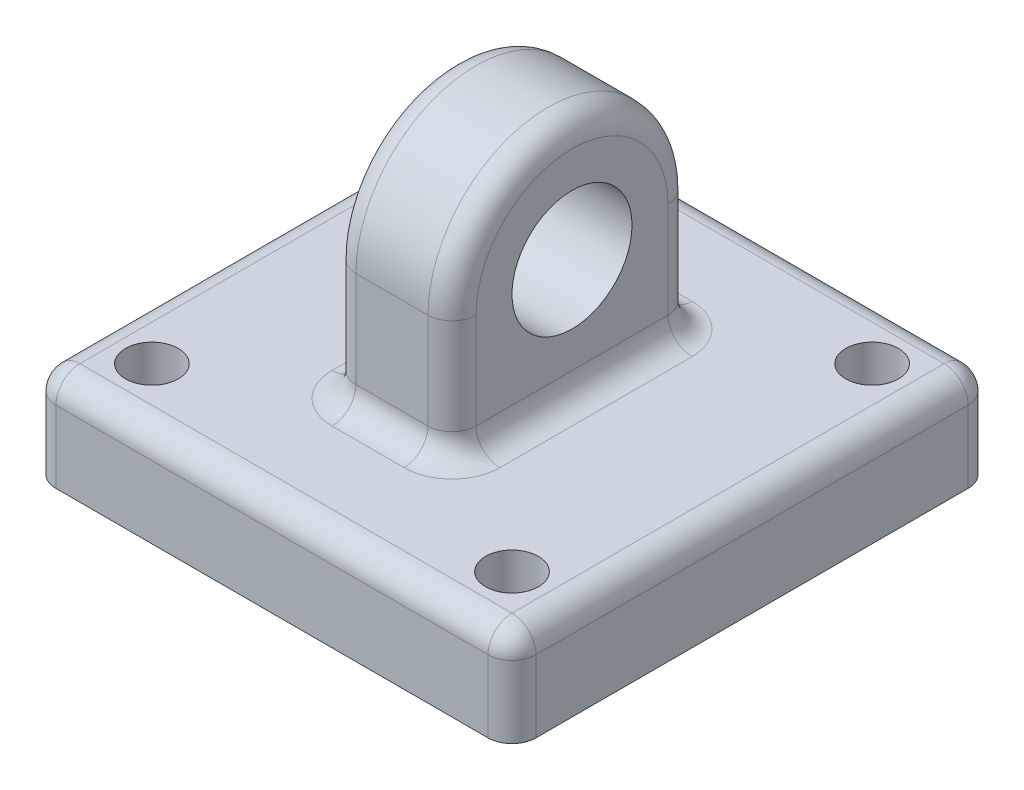
ISO-10303-21;
HEADER;
FILE_DESCRIPTION(('STEP AP214'),'2;1');
FILE_NAME('part.step','',(''),(''),'','','');
FILE_SCHEMA(('AUTOMOTIVE_DESIGN { 1 0 10303 214 1 1 1 1 }'));
ENDSEC;
DATA;
#1=APPLICATION_CONTEXT('core data for automotive mechanical design processes');
#2=APPLICATION_PROTOCOL_DEFINITION('international standard','automotive_design',2000,#1);
#3=PRODUCT_CONTEXT('',#1,'mechanical');
#4=PRODUCT('Part','Part','',(#3));
#5=PRODUCT_RELATED_PRODUCT_CATEGORY('part','',(#4));
#6=PRODUCT_DEFINITION_FORMATION('','',#4);
#7=PRODUCT_DEFINITION_CONTEXT('part definition',#1,'design');
#8=PRODUCT_DEFINITION('design','',#6,#7);
#9=PRODUCT_DEFINITION_SHAPE('','',#8);
#10=(LENGTH_UNIT() NAMED_UNIT(*) SI_UNIT(.MILLI.,.METRE.));
#11=(NAMED_UNIT(*) PLANE_ANGLE_UNIT() SI_UNIT($,.RADIAN.));
#12=(NAMED_UNIT(*) SI_UNIT($,.STERADIAN.) SOLID_ANGLE_UNIT());
#13=UNCERTAINTY_MEASURE_WITH_UNIT(LENGTH_MEASURE(1.E-05),#10,'distance_accuracy_value','');
#14=(GEOMETRIC_REPRESENTATION_CONTEXT(3) GLOBAL_UNCERTAINTY_ASSIGNED_CONTEXT((#13)) GLOBAL_UNIT_ASSIGNED_CONTEXT((#10,
#11,#12)) REPRESENTATION_CONTEXT('',''));
#15=CARTESIAN_POINT('',(0.,0.,0.));
#16=DIRECTION('',(0.,0.,1.));
#17=DIRECTION('',(1.,0.,0.));
#18=AXIS2_PLACEMENT_3D('',#15,#16,#17);
#19=CARTESIAN_POINT('',(0.,-5.,0.));
#20=DIRECTION('',(0.,1.,0.));
#21=DIRECTION('',(0.,0.,1.));
#22=AXIS2_PLACEMENT_3D('',#19,#20,#21);
#23=PLANE('',#22);
#24=CARTESIAN_POINT('',(7.5,-5.,7.5));
#25=DIRECTION('',(0.,1.,0.));
#26=DIRECTION('',(0.,0.,1.));
#27=AXIS2_PLACEMENT_3D('',#24,#25,#26);
#28=CIRCLE('',#27,1.1);
#29=CARTESIAN_POINT('',(7.5,-5.,8.6));
#30=VERTEX_POINT('',#29);
#31=EDGE_CURVE('E406',#30,#30,#28,.T.);
#32=ORIENTED_EDGE('',*,*,#31,.F.);
#33=EDGE_LOOP('',(#32));
#34=FACE_BOUND('',#33,.T.);
#35=CARTESIAN_POINT('',(7.5,-5.,-7.5));
#36=DIRECTION('',(0.,1.,0.));
#37=DIRECTION('',(0.,0.,1.));
#38=AXIS2_PLACEMENT_3D('',#35,#36,#37);
#39=CIRCLE('',#38,1.1);
#40=CARTESIAN_POINT('',(7.5,-5.,-6.4));
#41=VERTEX_POINT('',#40);
#42=EDGE_CURVE('E893',#41,#41,#39,.T.);
#43=ORIENTED_EDGE('',*,*,#42,.F.);
#44=EDGE_LOOP('',(#43));
#45=FACE_BOUND('',#44,.T.);
#46=CARTESIAN_POINT('',(-7.5,-5.,-7.5));
#47=DIRECTION('',(0.,1.,0.));
#48=DIRECTION('',(0.,0.,1.));
#49=AXIS2_PLACEMENT_3D('',#46,#47,#48);
#50=CIRCLE('',#49,1.1);
#51=CARTESIAN_POINT('',(-7.5,-5.,-6.4));
#52=VERTEX_POINT('',#51);
#53=EDGE_CURVE('E899',#52,#52,#50,.T.);
#54=ORIENTED_EDGE('',*,*,#53,.F.);
#55=EDGE_LOOP('',(#54));
#56=FACE_BOUND('',#55,.T.);
#57=CARTESIAN_POINT('',(-7.5,-5.,7.5));
#58=DIRECTION('',(0.,1.,0.));
#59=DIRECTION('',(0.,0.,1.));
#60=AXIS2_PLACEMENT_3D('',#57,#58,#59);
#61=CIRCLE('',#60,1.1);
#62=CARTESIAN_POINT('',(-7.5,-5.,8.6));
#63=VERTEX_POINT('',#62);
#64=EDGE_CURVE('E347',#63,#63,#61,.T.);
#65=ORIENTED_EDGE('',*,*,#64,.F.);
#66=EDGE_LOOP('',(#65));
#67=FACE_BOUND('',#66,.T.);
#68=DIRECTION('',(0.,0.,1.));
#69=VECTOR('',#68,1.);
#70=CARTESIAN_POINT('',(9.,-5.,-10.));
#71=LINE('',#70,#69);
#72=CARTESIAN_POINT('',(9.,-5.,9.));
#73=VERTEX_POINT('',#72);
#74=CARTESIAN_POINT('',(9.,-5.,-9.));
#75=VERTEX_POINT('',#74);
#76=EDGE_CURVE('E228',#73,#75,#71,.F.);
#77=ORIENTED_EDGE('',*,*,#76,.T.);
#78=DIRECTION('',(1.,0.,0.));
#79=VECTOR('',#78,1.);
#80=CARTESIAN_POINT('',(-10.,-5.,-9.));
#81=LINE('',#80,#79);
#82=CARTESIAN_POINT('',(-9.,-5.,-9.));
#83=VERTEX_POINT('',#82);
#84=EDGE_CURVE('E234',#75,#83,#81,.F.);
#85=ORIENTED_EDGE('',*,*,#84,.T.);
#86=DIRECTION('',(0.,0.,-1.));
#87=VECTOR('',#86,1.);
#88=CARTESIAN_POINT('',(-9.,-5.,10.));
#89=LINE('',#88,#87);
#90=CARTESIAN_POINT('',(-9.,-5.,9.));
#91=VERTEX_POINT('',#90);
#92=EDGE_CURVE('E232',#83,#91,#89,.F.);
#93=ORIENTED_EDGE('',*,*,#92,.T.);
#94=DIRECTION('',(-1.,0.,0.));
#95=VECTOR('',#94,1.);
#96=CARTESIAN_POINT('',(10.,-5.,9.));
#97=LINE('',#96,#95);
#98=EDGE_CURVE('E230',#91,#73,#97,.F.);
#99=ORIENTED_EDGE('',*,*,#98,.T.);
#100=EDGE_LOOP('',(#77,#85,#93,#99));
#101=FACE_BOUND('',#100,.T.);
#102=CARTESIAN_POINT('',(-1.5,-5.,-4.));
#103=DIRECTION('',(0.,1.,0.));
#104=DIRECTION('',(0.,0.,1.));
#105=AXIS2_PLACEMENT_3D('',#102,#103,#104);
#106=CIRCLE('',#105,2.);
#107=CARTESIAN_POINT('',(-1.5,-5.,-6.));
#108=VERTEX_POINT('',#107);
#109=CARTESIAN_POINT('',(-3.5,-5.,-4.));
#110=VERTEX_POINT('',#109);
#111=EDGE_CURVE('E255',#108,#110,#106,.T.);
#112=ORIENTED_EDGE('',*,*,#111,.F.);
#113=DIRECTION('',(-1.,0.,0.));
#114=VECTOR('',#113,1.);
#115=CARTESIAN_POINT('',(0.,-5.,-6.));
#116=LINE('',#115,#114);
#117=CARTESIAN_POINT('',(1.5,-5.,-6.));
#118=VERTEX_POINT('',#117);
#119=EDGE_CURVE('E252',#108,#118,#116,.F.);
#120=ORIENTED_EDGE('',*,*,#119,.T.);
#121=CARTESIAN_POINT('',(1.5,-5.,-4.));
#122=DIRECTION('',(0.,1.,0.));
#123=DIRECTION('',(0.,0.,1.));
#124=AXIS2_PLACEMENT_3D('',#121,#122,#123);
#125=CIRCLE('',#124,2.);
#126=CARTESIAN_POINT('',(3.5,-5.,-4.));
#127=VERTEX_POINT('',#126);
#128=EDGE_CURVE('E249',#127,#118,#125,.T.);
#129=ORIENTED_EDGE('',*,*,#128,.F.);
#130=DIRECTION('',(0.,0.,-1.));
#131=VECTOR('',#130,1.);
#132=CARTESIAN_POINT('',(3.5,-5.,5.));
#133=LINE('',#132,#131);
#134=CARTESIAN_POINT('',(3.5,-5.,4.));
#135=VERTEX_POINT('',#134);
#136=EDGE_CURVE('E247',#127,#135,#133,.F.);
#137=ORIENTED_EDGE('',*,*,#136,.T.);
#138=CARTESIAN_POINT('',(1.5,-5.,4.));
#139=DIRECTION('',(0.,1.,0.));
#140=DIRECTION('',(0.,0.,1.));
#141=AXIS2_PLACEMENT_3D('',#138,#139,#140);
#142=CIRCLE('',#141,2.);
#143=CARTESIAN_POINT('',(1.5,-5.,6.));
#144=VERTEX_POINT('',#143);
#145=EDGE_CURVE('E244',#144,#135,#142,.T.);
#146=ORIENTED_EDGE('',*,*,#145,.F.);
#147=DIRECTION('',(-1.,0.,0.));
#148=VECTOR('',#147,1.);
#149=CARTESIAN_POINT('',(0.,-5.,6.));
#150=LINE('',#149,#148);
#151=CARTESIAN_POINT('',(-1.5,-5.,6.));
#152=VERTEX_POINT('',#151);
#153=EDGE_CURVE('E240',#144,#152,#150,.T.);
#154=ORIENTED_EDGE('',*,*,#153,.T.);
#155=CARTESIAN_POINT('',(-1.5,-5.,4.));
#156=DIRECTION('',(0.,1.,0.));
#157=DIRECTION('',(0.,0.,1.));
#158=AXIS2_PLACEMENT_3D('',#155,#156,#157);
#159=CIRCLE('',#158,2.);
#160=CARTESIAN_POINT('',(-3.5,-5.,4.));
#161=VERTEX_POINT('',#160);
#162=EDGE_CURVE('E237',#161,#152,#159,.T.);
#163=ORIENTED_EDGE('',*,*,#162,.F.);
#164=DIRECTION('',(0.,0.,-1.));
#165=VECTOR('',#164,1.);
#166=CARTESIAN_POINT('',(-3.5,-5.,0.));
#167=LINE('',#166,#165);
#168=EDGE_CURVE('E242',#161,#110,#167,.T.);
#169=ORIENTED_EDGE('',*,*,#168,.T.);
#170=EDGE_LOOP('',(#112,#120,#129,#137,#146,#154,#163,#169));
#171=FACE_BOUND('',#170,.T.);
#172=ADVANCED_FACE('F35',(#34,#45,#56,#67,#101,#171),#23,.T.);
#173=CARTESIAN_POINT('',(2.5,0.,0.));
#174=DIRECTION('',(1.,0.,0.));
#175=DIRECTION('',(0.,0.,-1.));
#176=AXIS2_PLACEMENT_3D('',#173,#174,#175);
#177=PLANE('',#176);
#178=DIRECTION('',(0.,-1.,0.));
#179=VECTOR('',#178,1.);
#180=CARTESIAN_POINT('',(2.5,-5.,4.));
#181=LINE('',#180,#179);
#182=CARTESIAN_POINT('',(2.5,0.,4.));
#183=VERTEX_POINT('',#182);
#184=CARTESIAN_POINT('',(2.5,-4.,4.));
#185=VERTEX_POINT('',#184);
#186=EDGE_CURVE('E258',#183,#185,#181,.T.);
#187=ORIENTED_EDGE('',*,*,#186,.T.);
#188=DIRECTION('',(0.,0.,-1.));
#189=VECTOR('',#188,1.);
#190=CARTESIAN_POINT('',(2.5,-4.,-5.));
#191=LINE('',#190,#189);
#192=CARTESIAN_POINT('',(2.5,-4.,-4.));
#193=VERTEX_POINT('',#192);
#194=EDGE_CURVE('E263',#185,#193,#191,.T.);
#195=ORIENTED_EDGE('',*,*,#194,.T.);
#196=DIRECTION('',(0.,1.,0.));
#197=VECTOR('',#196,1.);
#198=CARTESIAN_POINT('',(2.5,0.,-4.));
#199=LINE('',#198,#197);
#200=CARTESIAN_POINT('',(2.5,0.,-4.));
#201=VERTEX_POINT('',#200);
#202=EDGE_CURVE('E261',#193,#201,#199,.T.);
#203=ORIENTED_EDGE('',*,*,#202,.T.);
#204=CARTESIAN_POINT('',(2.5,0.,0.));
#205=DIRECTION('',(1.,0.,0.));
#206=DIRECTION('',(0.,0.,-1.));
#207=AXIS2_PLACEMENT_3D('',#204,#205,#206);
#208=CIRCLE('',#207,4.);
#209=EDGE_CURVE('E213',#201,#183,#208,.T.);
#210=ORIENTED_EDGE('',*,*,#209,.T.);
#211=EDGE_LOOP('',(#187,#195,#203,#210));
#212=FACE_BOUND('',#211,.T.);
#213=CARTESIAN_POINT('',(2.5,0.,0.));
#214=DIRECTION('',(1.,0.,0.));
#215=DIRECTION('',(0.,0.,-1.));
#216=AXIS2_PLACEMENT_3D('',#213,#214,#215);
#217=CIRCLE('',#216,2.5);
#218=CARTESIAN_POINT('',(2.5,0.,-2.5));
#219=VERTEX_POINT('',#218);
#220=EDGE_CURVE('E207',#219,#219,#217,.T.);
#221=ORIENTED_EDGE('',*,*,#220,.F.);
#222=EDGE_LOOP('',(#221));
#223=FACE_BOUND('',#222,.T.);
#224=ADVANCED_FACE('F435',(#212,#223),#177,.T.);
#225=CARTESIAN_POINT('',(-2.5,0.,0.));
#226=DIRECTION('',(1.,0.,0.));
#227=DIRECTION('',(0.,0.,-1.));
#228=AXIS2_PLACEMENT_3D('',#225,#226,#227);
#229=PLANE('',#228);
#230=DIRECTION('',(0.,1.,0.));
#231=VECTOR('',#230,1.);
#232=CARTESIAN_POINT('',(-2.5,0.,-4.));
#233=LINE('',#232,#231);
#234=CARTESIAN_POINT('',(-2.5,0.,-4.));
#235=VERTEX_POINT('',#234);
#236=CARTESIAN_POINT('',(-2.5,-4.,-4.));
#237=VERTEX_POINT('',#236);
#238=EDGE_CURVE('E270',#235,#237,#233,.F.);
#239=ORIENTED_EDGE('',*,*,#238,.T.);
#240=DIRECTION('',(0.,0.,-1.));
#241=VECTOR('',#240,1.);
#242=CARTESIAN_POINT('',(-2.5,-4.,0.));
#243=LINE('',#242,#241);
#244=CARTESIAN_POINT('',(-2.5,-4.,4.));
#245=VERTEX_POINT('',#244);
#246=EDGE_CURVE('E197',#237,#245,#243,.F.);
#247=ORIENTED_EDGE('',*,*,#246,.T.);
#248=DIRECTION('',(0.,-1.,0.));
#249=VECTOR('',#248,1.);
#250=CARTESIAN_POINT('',(-2.5,0.,4.));
#251=LINE('',#250,#249);
#252=CARTESIAN_POINT('',(-2.5,0.,4.));
#253=VERTEX_POINT('',#252);
#254=EDGE_CURVE('E266',#245,#253,#251,.F.);
#255=ORIENTED_EDGE('',*,*,#254,.T.);
#256=CARTESIAN_POINT('',(-2.5,0.,0.));
#257=DIRECTION('',(1.,0.,0.));
#258=DIRECTION('',(0.,0.,-1.));
#259=AXIS2_PLACEMENT_3D('',#256,#257,#258);
#260=CIRCLE('',#259,4.);
#261=EDGE_CURVE('E268',#253,#235,#260,.F.);
#262=ORIENTED_EDGE('',*,*,#261,.T.);
#263=EDGE_LOOP('',(#239,#247,#255,#262));
#264=FACE_BOUND('',#263,.T.);
#265=CARTESIAN_POINT('',(-2.5,0.,0.));
#266=DIRECTION('',(1.,0.,0.));
#267=DIRECTION('',(0.,0.,-1.));
#268=AXIS2_PLACEMENT_3D('',#265,#266,#267);
#269=CIRCLE('',#268,2.5);
#270=CARTESIAN_POINT('',(-2.5,0.,-2.5));
#271=VERTEX_POINT('',#270);
#272=EDGE_CURVE('E413',#271,#271,#269,.T.);
#273=ORIENTED_EDGE('',*,*,#272,.T.);
#274=EDGE_LOOP('',(#273));
#275=FACE_BOUND('',#274,.T.);
#276=ADVANCED_FACE('F419',(#264,#275),#229,.F.);
#277=CARTESIAN_POINT('',(2.5,0.,0.));
#278=DIRECTION('',(-1.,0.,0.));
#279=DIRECTION('',(0.,0.,1.));
#280=AXIS2_PLACEMENT_3D('',#277,#278,#279);
#281=CYLINDRICAL_SURFACE('',#280,5.);
#282=DIRECTION('',(-1.,0.,0.));
#283=VECTOR('',#282,1.);
#284=CARTESIAN_POINT('',(2.5,0.,-5.));
#285=LINE('',#284,#283);
#286=CARTESIAN_POINT('',(1.5,0.,-5.));
#287=VERTEX_POINT('',#286);
#288=CARTESIAN_POINT('',(-1.5,0.,-5.));
#289=VERTEX_POINT('',#288);
#290=EDGE_CURVE('E188',#287,#289,#285,.T.);
#291=ORIENTED_EDGE('',*,*,#290,.T.);
#292=CARTESIAN_POINT('',(-1.5,0.,0.));
#293=DIRECTION('',(1.,0.,0.));
#294=DIRECTION('',(0.,0.,-1.));
#295=AXIS2_PLACEMENT_3D('',#292,#293,#294);
#296=CIRCLE('',#295,5.);
#297=CARTESIAN_POINT('',(-1.5,0.,5.));
#298=VERTEX_POINT('',#297);
#299=EDGE_CURVE('E196',#289,#298,#296,.T.);
#300=ORIENTED_EDGE('',*,*,#299,.T.);
#301=DIRECTION('',(-1.,0.,0.));
#302=VECTOR('',#301,1.);
#303=CARTESIAN_POINT('',(2.5,0.,5.));
#304=LINE('',#303,#302);
#305=CARTESIAN_POINT('',(1.5,0.,5.));
#306=VERTEX_POINT('',#305);
#307=EDGE_CURVE('E191',#306,#298,#304,.T.);
#308=ORIENTED_EDGE('',*,*,#307,.F.);
#309=CARTESIAN_POINT('',(1.5,0.,0.));
#310=DIRECTION('',(1.,0.,0.));
#311=DIRECTION('',(0.,0.,-1.));
#312=AXIS2_PLACEMENT_3D('',#309,#310,#311);
#313=CIRCLE('',#312,5.);
#314=EDGE_CURVE('E185',#306,#287,#313,.F.);
#315=ORIENTED_EDGE('',*,*,#314,.T.);
#316=EDGE_LOOP('',(#291,#300,#308,#315));
#317=FACE_BOUND('',#316,.T.);
#318=ADVANCED_FACE('F187',(#317),#281,.T.);
#319=CARTESIAN_POINT('',(2.5,0.,5.));
#320=DIRECTION('',(0.,0.,-1.));
#321=DIRECTION('',(0.,1.,0.));
#322=AXIS2_PLACEMENT_3D('',#319,#320,#321);
#323=PLANE('',#322);
#324=ORIENTED_EDGE('',*,*,#307,.T.);
#325=DIRECTION('',(0.,-1.,0.));
#326=VECTOR('',#325,1.);
#327=CARTESIAN_POINT('',(-1.5,0.,5.));
#328=LINE('',#327,#326);
#329=CARTESIAN_POINT('',(-1.5,-4.,5.));
#330=VERTEX_POINT('',#329);
#331=EDGE_CURVE('E279',#298,#330,#328,.T.);
#332=ORIENTED_EDGE('',*,*,#331,.T.);
#333=DIRECTION('',(-1.,0.,0.));
#334=VECTOR('',#333,1.);
#335=CARTESIAN_POINT('',(2.5,-4.,5.));
#336=LINE('',#335,#334);
#337=CARTESIAN_POINT('',(1.5,-4.,5.));
#338=VERTEX_POINT('',#337);
#339=EDGE_CURVE('E277',#330,#338,#336,.F.);
#340=ORIENTED_EDGE('',*,*,#339,.T.);
#341=DIRECTION('',(0.,-1.,0.));
#342=VECTOR('',#341,1.);
#343=CARTESIAN_POINT('',(1.5,0.,5.));
#344=LINE('',#343,#342);
#345=EDGE_CURVE('E275',#338,#306,#344,.F.);
#346=ORIENTED_EDGE('',*,*,#345,.T.);
#347=EDGE_LOOP('',(#324,#332,#340,#346));
#348=FACE_BOUND('',#347,.T.);
#349=ADVANCED_FACE('F431',(#348),#323,.F.);
#350=CARTESIAN_POINT('',(2.5,0.,-5.));
#351=DIRECTION('',(0.,0.,1.));
#352=DIRECTION('',(1.,0.,0.));
#353=AXIS2_PLACEMENT_3D('',#350,#351,#352);
#354=PLANE('',#353);
#355=DIRECTION('',(-1.,0.,0.));
#356=VECTOR('',#355,1.);
#357=CARTESIAN_POINT('',(2.5,-4.,-5.));
#358=LINE('',#357,#356);
#359=CARTESIAN_POINT('',(1.5,-4.,-5.));
#360=VERTEX_POINT('',#359);
#361=CARTESIAN_POINT('',(-1.5,-4.,-5.));
#362=VERTEX_POINT('',#361);
#363=EDGE_CURVE('E222',#360,#362,#358,.T.);
#364=ORIENTED_EDGE('',*,*,#363,.T.);
#365=DIRECTION('',(0.,1.,0.));
#366=VECTOR('',#365,1.);
#367=CARTESIAN_POINT('',(-1.5,0.,-5.));
#368=LINE('',#367,#366);
#369=EDGE_CURVE('E206',#362,#289,#368,.T.);
#370=ORIENTED_EDGE('',*,*,#369,.T.);
#371=ORIENTED_EDGE('',*,*,#290,.F.);
#372=DIRECTION('',(0.,1.,0.));
#373=VECTOR('',#372,1.);
#374=CARTESIAN_POINT('',(1.5,-5.,-5.));
#375=LINE('',#374,#373);
#376=EDGE_CURVE('E203',#287,#360,#375,.F.);
#377=ORIENTED_EDGE('',*,*,#376,.T.);
#378=EDGE_LOOP('',(#364,#370,#371,#377));
#379=FACE_BOUND('',#378,.T.);
#380=ADVANCED_FACE('F201',(#379),#354,.F.);
#381=CARTESIAN_POINT('',(2.5,0.,0.));
#382=DIRECTION('',(-1.,0.,0.));
#383=DIRECTION('',(0.,0.,1.));
#384=AXIS2_PLACEMENT_3D('',#381,#382,#383);
#385=CYLINDRICAL_SURFACE('',#384,2.5);
#386=ORIENTED_EDGE('',*,*,#220,.T.);
#387=EDGE_LOOP('',(#386));
#388=FACE_BOUND('',#387,.T.);
#389=ORIENTED_EDGE('',*,*,#272,.F.);
#390=EDGE_LOOP('',(#389));
#391=FACE_BOUND('',#390,.T.);
#392=ADVANCED_FACE('F421',(#388,#391),#385,.F.);
#393=CARTESIAN_POINT('',(-10.,-9.,-10.));
#394=DIRECTION('',(1.,0.,0.));
#395=DIRECTION('',(0.,0.,-1.));
#396=AXIS2_PLACEMENT_3D('',#393,#394,#395);
#397=PLANE('',#396);
#398=DIRECTION('',(0.,0.,-1.));
#399=VECTOR('',#398,1.);
#400=CARTESIAN_POINT('',(-10.,-9.,-10.));
#401=LINE('',#400,#399);
#402=CARTESIAN_POINT('',(-10.,-9.,9.));
#403=VERTEX_POINT('',#402);
#404=CARTESIAN_POINT('',(-10.,-9.,-9.));
#405=VERTEX_POINT('',#404);
#406=EDGE_CURVE('E392',#403,#405,#401,.T.);
#407=ORIENTED_EDGE('',*,*,#406,.F.);
#408=DIRECTION('',(0.,1.,0.));
#409=VECTOR('',#408,1.);
#410=CARTESIAN_POINT('',(-10.,-9.,9.));
#411=LINE('',#410,#409);
#412=CARTESIAN_POINT('',(-10.,-6.,9.));
#413=VERTEX_POINT('',#412);
#414=EDGE_CURVE('E306',#403,#413,#411,.T.);
#415=ORIENTED_EDGE('',*,*,#414,.T.);
#416=DIRECTION('',(0.,0.,-1.));
#417=VECTOR('',#416,1.);
#418=CARTESIAN_POINT('',(-10.,-6.,-10.));
#419=LINE('',#418,#417);
#420=CARTESIAN_POINT('',(-10.,-6.,-9.));
#421=VERTEX_POINT('',#420);
#422=EDGE_CURVE('E302',#413,#421,#419,.T.);
#423=ORIENTED_EDGE('',*,*,#422,.T.);
#424=DIRECTION('',(0.,1.,0.));
#425=VECTOR('',#424,1.);
#426=CARTESIAN_POINT('',(-10.,-9.,-9.));
#427=LINE('',#426,#425);
#428=EDGE_CURVE('E304',#421,#405,#427,.F.);
#429=ORIENTED_EDGE('',*,*,#428,.T.);
#430=EDGE_LOOP('',(#407,#415,#423,#429));
#431=FACE_BOUND('',#430,.T.);
#432=ADVANCED_FACE('F391',(#431),#397,.F.);
#433=CARTESIAN_POINT('',(-10.,-9.,-10.));
#434=DIRECTION('',(0.,0.,1.));
#435=DIRECTION('',(1.,0.,0.));
#436=AXIS2_PLACEMENT_3D('',#433,#434,#435);
#437=PLANE('',#436);
#438=DIRECTION('',(1.,0.,0.));
#439=VECTOR('',#438,1.);
#440=CARTESIAN_POINT('',(-10.,-9.,-10.));
#441=LINE('',#440,#439);
#442=CARTESIAN_POINT('',(-9.,-9.,-10.));
#443=VERTEX_POINT('',#442);
#444=CARTESIAN_POINT('',(9.,-9.,-10.));
#445=VERTEX_POINT('',#444);
#446=EDGE_CURVE('E400',#443,#445,#441,.T.);
#447=ORIENTED_EDGE('',*,*,#446,.F.);
#448=DIRECTION('',(0.,1.,0.));
#449=VECTOR('',#448,1.);
#450=CARTESIAN_POINT('',(-9.,-9.,-10.));
#451=LINE('',#450,#449);
#452=CARTESIAN_POINT('',(-9.,-6.,-10.));
#453=VERTEX_POINT('',#452);
#454=EDGE_CURVE('E11',#443,#453,#451,.T.);
#455=ORIENTED_EDGE('',*,*,#454,.T.);
#456=DIRECTION('',(1.,0.,0.));
#457=VECTOR('',#456,1.);
#458=CARTESIAN_POINT('',(10.,-6.,-10.));
#459=LINE('',#458,#457);
#460=CARTESIAN_POINT('',(9.,-6.,-10.));
#461=VERTEX_POINT('',#460);
#462=EDGE_CURVE('E51',#453,#461,#459,.T.);
#463=ORIENTED_EDGE('',*,*,#462,.T.);
#464=DIRECTION('',(0.,1.,0.));
#465=VECTOR('',#464,1.);
#466=CARTESIAN_POINT('',(9.,-9.,-10.));
#467=LINE('',#466,#465);
#468=EDGE_CURVE('E44',#461,#445,#467,.F.);
#469=ORIENTED_EDGE('',*,*,#468,.T.);
#470=EDGE_LOOP('',(#447,#455,#463,#469));
#471=FACE_BOUND('',#470,.T.);
#472=ADVANCED_FACE('F429',(#471),#437,.F.);
#473=CARTESIAN_POINT('',(10.,-9.,-10.));
#474=DIRECTION('',(-1.,0.,0.));
#475=DIRECTION('',(0.,0.,1.));
#476=AXIS2_PLACEMENT_3D('',#473,#474,#475);
#477=PLANE('',#476);
#478=DIRECTION('',(0.,0.,1.));
#479=VECTOR('',#478,1.);
#480=CARTESIAN_POINT('',(10.,-6.,10.));
#481=LINE('',#480,#479);
#482=CARTESIAN_POINT('',(10.,-6.,-9.));
#483=VERTEX_POINT('',#482);
#484=CARTESIAN_POINT('',(10.,-6.,9.));
#485=VERTEX_POINT('',#484);
#486=EDGE_CURVE('E288',#483,#485,#481,.T.);
#487=ORIENTED_EDGE('',*,*,#486,.T.);
#488=DIRECTION('',(0.,1.,0.));
#489=VECTOR('',#488,1.);
#490=CARTESIAN_POINT('',(10.,-9.,9.));
#491=LINE('',#490,#489);
#492=CARTESIAN_POINT('',(10.,-9.,9.));
#493=VERTEX_POINT('',#492);
#494=EDGE_CURVE('E292',#485,#493,#491,.F.);
#495=ORIENTED_EDGE('',*,*,#494,.T.);
#496=DIRECTION('',(0.,0.,1.));
#497=VECTOR('',#496,1.);
#498=CARTESIAN_POINT('',(10.,-9.,-10.));
#499=LINE('',#498,#497);
#500=CARTESIAN_POINT('',(10.,-9.,-9.));
#501=VERTEX_POINT('',#500);
#502=EDGE_CURVE('E403',#501,#493,#499,.T.);
#503=ORIENTED_EDGE('',*,*,#502,.F.);
#504=DIRECTION('',(0.,1.,0.));
#505=VECTOR('',#504,1.);
#506=CARTESIAN_POINT('',(10.,-9.,-9.));
#507=LINE('',#506,#505);
#508=EDGE_CURVE('E290',#501,#483,#507,.T.);
#509=ORIENTED_EDGE('',*,*,#508,.T.);
#510=EDGE_LOOP('',(#487,#495,#503,#509));
#511=FACE_BOUND('',#510,.T.);
#512=ADVANCED_FACE('F450',(#511),#477,.F.);
#513=CARTESIAN_POINT('',(-10.,-9.,10.));
#514=DIRECTION('',(0.,0.,-1.));
#515=DIRECTION('',(-1.,0.,0.));
#516=AXIS2_PLACEMENT_3D('',#513,#514,#515);
#517=PLANE('',#516);
#518=DIRECTION('',(-1.,0.,0.));
#519=VECTOR('',#518,1.);
#520=CARTESIAN_POINT('',(-10.,-9.,10.));
#521=LINE('',#520,#519);
#522=CARTESIAN_POINT('',(9.,-9.,10.));
#523=VERTEX_POINT('',#522);
#524=CARTESIAN_POINT('',(-9.,-9.,10.));
#525=VERTEX_POINT('',#524);
#526=EDGE_CURVE('E411',#523,#525,#521,.T.);
#527=ORIENTED_EDGE('',*,*,#526,.F.);
#528=DIRECTION('',(0.,1.,0.));
#529=VECTOR('',#528,1.);
#530=CARTESIAN_POINT('',(9.,-9.,10.));
#531=LINE('',#530,#529);
#532=CARTESIAN_POINT('',(9.,-6.,10.));
#533=VERTEX_POINT('',#532);
#534=EDGE_CURVE('E285',#523,#533,#531,.T.);
#535=ORIENTED_EDGE('',*,*,#534,.T.);
#536=DIRECTION('',(-1.,0.,0.));
#537=VECTOR('',#536,1.);
#538=CARTESIAN_POINT('',(-10.,-6.,10.));
#539=LINE('',#538,#537);
#540=CARTESIAN_POINT('',(-9.,-6.,10.));
#541=VERTEX_POINT('',#540);
#542=EDGE_CURVE('E281',#533,#541,#539,.T.);
#543=ORIENTED_EDGE('',*,*,#542,.T.);
#544=DIRECTION('',(0.,1.,0.));
#545=VECTOR('',#544,1.);
#546=CARTESIAN_POINT('',(-9.,-9.,10.));
#547=LINE('',#546,#545);
#548=EDGE_CURVE('E283',#541,#525,#547,.F.);
#549=ORIENTED_EDGE('',*,*,#548,.T.);
#550=EDGE_LOOP('',(#527,#535,#543,#549));
#551=FACE_BOUND('',#550,.T.);
#552=ADVANCED_FACE('F447',(#551),#517,.F.);
#553=CARTESIAN_POINT('',(0.,-9.,0.));
#554=DIRECTION('',(0.,1.,0.));
#555=DIRECTION('',(0.,0.,1.));
#556=AXIS2_PLACEMENT_3D('',#553,#554,#555);
#557=PLANE('',#556);
#558=CARTESIAN_POINT('',(-7.5,-9.,7.5));
#559=DIRECTION('',(0.,1.,0.));
#560=DIRECTION('',(0.,0.,1.));
#561=AXIS2_PLACEMENT_3D('',#558,#559,#560);
#562=CIRCLE('',#561,1.1);
#563=CARTESIAN_POINT('',(-7.5,-9.,8.6));
#564=VERTEX_POINT('',#563);
#565=EDGE_CURVE('E881',#564,#564,#562,.F.);
#566=ORIENTED_EDGE('',*,*,#565,.F.);
#567=EDGE_LOOP('',(#566));
#568=FACE_BOUND('',#567,.T.);
#569=CARTESIAN_POINT('',(-7.5,-9.,-7.5));
#570=DIRECTION('',(0.,1.,0.));
#571=DIRECTION('',(0.,0.,1.));
#572=AXIS2_PLACEMENT_3D('',#569,#570,#571);
#573=CIRCLE('',#572,1.1);
#574=CARTESIAN_POINT('',(-7.5,-9.,-6.4));
#575=VERTEX_POINT('',#574);
#576=EDGE_CURVE('E885',#575,#575,#573,.F.);
#577=ORIENTED_EDGE('',*,*,#576,.F.);
#578=EDGE_LOOP('',(#577));
#579=FACE_BOUND('',#578,.T.);
#580=CARTESIAN_POINT('',(7.5,-9.,-7.5));
#581=DIRECTION('',(0.,1.,0.));
#582=DIRECTION('',(0.,0.,1.));
#583=AXIS2_PLACEMENT_3D('',#580,#581,#582);
#584=CIRCLE('',#583,1.1);
#585=CARTESIAN_POINT('',(7.5,-9.,-6.4));
#586=VERTEX_POINT('',#585);
#587=EDGE_CURVE('E889',#586,#586,#584,.F.);
#588=ORIENTED_EDGE('',*,*,#587,.F.);
#589=EDGE_LOOP('',(#588));
#590=FACE_BOUND('',#589,.T.);
#591=CARTESIAN_POINT('',(7.5,-9.,7.5));
#592=DIRECTION('',(0.,1.,0.));
#593=DIRECTION('',(0.,0.,1.));
#594=AXIS2_PLACEMENT_3D('',#591,#592,#593);
#595=CIRCLE('',#594,1.1);
#596=CARTESIAN_POINT('',(7.5,-9.,8.6));
#597=VERTEX_POINT('',#596);
#598=EDGE_CURVE('E401',#597,#597,#595,.F.);
#599=ORIENTED_EDGE('',*,*,#598,.F.);
#600=EDGE_LOOP('',(#599));
#601=FACE_BOUND('',#600,.T.);
#602=ORIENTED_EDGE('',*,*,#502,.T.);
#603=CARTESIAN_POINT('',(9.,-9.,9.));
#604=DIRECTION('',(0.,1.,0.));
#605=DIRECTION('',(0.,0.,1.));
#606=AXIS2_PLACEMENT_3D('',#603,#604,#605);
#607=CIRCLE('',#606,1.);
#608=EDGE_CURVE('E300',#493,#523,#607,.F.);
#609=ORIENTED_EDGE('',*,*,#608,.T.);
#610=ORIENTED_EDGE('',*,*,#526,.T.);
#611=CARTESIAN_POINT('',(-9.,-9.,9.));
#612=DIRECTION('',(0.,1.,0.));
#613=DIRECTION('',(0.,0.,1.));
#614=AXIS2_PLACEMENT_3D('',#611,#612,#613);
#615=CIRCLE('',#614,1.);
#616=EDGE_CURVE('E298',#525,#403,#615,.F.);
#617=ORIENTED_EDGE('',*,*,#616,.T.);
#618=ORIENTED_EDGE('',*,*,#406,.T.);
#619=CARTESIAN_POINT('',(-9.,-9.,-9.));
#620=DIRECTION('',(0.,1.,0.));
#621=DIRECTION('',(0.,0.,1.));
#622=AXIS2_PLACEMENT_3D('',#619,#620,#621);
#623=CIRCLE('',#622,1.);
#624=EDGE_CURVE('E296',#405,#443,#623,.F.);
#625=ORIENTED_EDGE('',*,*,#624,.T.);
#626=ORIENTED_EDGE('',*,*,#446,.T.);
#627=CARTESIAN_POINT('',(9.,-9.,-9.));
#628=DIRECTION('',(0.,1.,0.));
#629=DIRECTION('',(0.,0.,1.));
#630=AXIS2_PLACEMENT_3D('',#627,#628,#629);
#631=CIRCLE('',#630,1.);
#632=EDGE_CURVE('E294',#445,#501,#631,.F.);
#633=ORIENTED_EDGE('',*,*,#632,.T.);
#634=EDGE_LOOP('',(#602,#609,#610,#617,#618,#625,#626,#633));
#635=FACE_BOUND('',#634,.T.);
#636=ADVANCED_FACE('F396',(#568,#579,#590,#601,#635),#557,.F.);
#637=CARTESIAN_POINT('',(7.5,-9.001,7.5));
#638=DIRECTION('',(0.,1.,0.));
#639=DIRECTION('',(0.,0.,1.));
#640=AXIS2_PLACEMENT_3D('',#637,#638,#639);
#641=CYLINDRICAL_SURFACE('',#640,1.1);
#642=ORIENTED_EDGE('',*,*,#31,.T.);
#643=EDGE_LOOP('',(#642));
#644=FACE_BOUND('',#643,.T.);
#645=ORIENTED_EDGE('',*,*,#598,.T.);
#646=EDGE_LOOP('',(#645));
#647=FACE_BOUND('',#646,.T.);
#648=ADVANCED_FACE('F755',(#644,#647),#641,.F.);
#649=CARTESIAN_POINT('',(7.5,-9.001,-7.5));
#650=DIRECTION('',(0.,1.,0.));
#651=DIRECTION('',(0.,0.,1.));
#652=AXIS2_PLACEMENT_3D('',#649,#650,#651);
#653=CYLINDRICAL_SURFACE('',#652,1.1);
#654=ORIENTED_EDGE('',*,*,#42,.T.);
#655=EDGE_LOOP('',(#654));
#656=FACE_BOUND('',#655,.T.);
#657=ORIENTED_EDGE('',*,*,#587,.T.);
#658=EDGE_LOOP('',(#657));
#659=FACE_BOUND('',#658,.T.);
#660=ADVANCED_FACE('F746',(#656,#659),#653,.F.);
#661=CARTESIAN_POINT('',(-7.5,-9.001,-7.5));
#662=DIRECTION('',(0.,1.,0.));
#663=DIRECTION('',(0.,0.,1.));
#664=AXIS2_PLACEMENT_3D('',#661,#662,#663);
#665=CYLINDRICAL_SURFACE('',#664,1.1);
#666=ORIENTED_EDGE('',*,*,#53,.T.);
#667=EDGE_LOOP('',(#666));
#668=FACE_BOUND('',#667,.T.);
#669=ORIENTED_EDGE('',*,*,#576,.T.);
#670=EDGE_LOOP('',(#669));
#671=FACE_BOUND('',#670,.T.);
#672=ADVANCED_FACE('F737',(#668,#671),#665,.F.);
#673=CARTESIAN_POINT('',(-7.5,-9.001,7.5));
#674=DIRECTION('',(0.,1.,0.));
#675=DIRECTION('',(0.,0.,1.));
#676=AXIS2_PLACEMENT_3D('',#673,#674,#675);
#677=CYLINDRICAL_SURFACE('',#676,1.1);
#678=ORIENTED_EDGE('',*,*,#64,.T.);
#679=EDGE_LOOP('',(#678));
#680=FACE_BOUND('',#679,.T.);
#681=ORIENTED_EDGE('',*,*,#565,.T.);
#682=EDGE_LOOP('',(#681));
#683=FACE_BOUND('',#682,.T.);
#684=ADVANCED_FACE('F572',(#680,#683),#677,.F.);
#685=CARTESIAN_POINT('',(1.5,0.,4.));
#686=DIRECTION('',(0.,1.,0.));
#687=DIRECTION('',(0.,0.,1.));
#688=AXIS2_PLACEMENT_3D('',#685,#686,#687);
#689=CYLINDRICAL_SURFACE('',#688,1.);
#690=CARTESIAN_POINT('',(1.5,0.,4.));
#691=DIRECTION('',(0.,1.,0.));
#692=DIRECTION('',(0.,0.,1.));
#693=AXIS2_PLACEMENT_3D('',#690,#691,#692);
#694=CIRCLE('',#693,1.);
#695=EDGE_CURVE('E339',#306,#183,#694,.T.);
#696=ORIENTED_EDGE('',*,*,#695,.F.);
#697=ORIENTED_EDGE('',*,*,#345,.F.);
#698=CARTESIAN_POINT('',(1.5,-4.,4.));
#699=DIRECTION('',(0.,1.,0.));
#700=DIRECTION('',(0.,0.,1.));
#701=AXIS2_PLACEMENT_3D('',#698,#699,#700);
#702=CIRCLE('',#701,1.);
#703=EDGE_CURVE('E341',#185,#338,#702,.F.);
#704=ORIENTED_EDGE('',*,*,#703,.F.);
#705=ORIENTED_EDGE('',*,*,#186,.F.);
#706=EDGE_LOOP('',(#696,#697,#704,#705));
#707=FACE_BOUND('',#706,.T.);
#708=ADVANCED_FACE('F568',(#707),#689,.T.);
#709=CARTESIAN_POINT('',(-1.5,0.,4.));
#710=DIRECTION('',(0.,-1.,0.));
#711=DIRECTION('',(0.,0.,-1.));
#712=AXIS2_PLACEMENT_3D('',#709,#710,#711);
#713=CYLINDRICAL_SURFACE('',#712,1.);
#714=CARTESIAN_POINT('',(-1.5,-4.,4.));
#715=DIRECTION('',(0.,1.,0.));
#716=DIRECTION('',(0.,0.,1.));
#717=AXIS2_PLACEMENT_3D('',#714,#715,#716);
#718=CIRCLE('',#717,1.);
#719=EDGE_CURVE('E333',#330,#245,#718,.F.);
#720=ORIENTED_EDGE('',*,*,#719,.F.);
#721=ORIENTED_EDGE('',*,*,#331,.F.);
#722=CARTESIAN_POINT('',(-1.5,0.,4.));
#723=DIRECTION('',(0.,1.,0.));
#724=DIRECTION('',(0.,0.,1.));
#725=AXIS2_PLACEMENT_3D('',#722,#723,#724);
#726=CIRCLE('',#725,1.);
#727=EDGE_CURVE('E336',#253,#298,#726,.T.);
#728=ORIENTED_EDGE('',*,*,#727,.F.);
#729=ORIENTED_EDGE('',*,*,#254,.F.);
#730=EDGE_LOOP('',(#720,#721,#728,#729));
#731=FACE_BOUND('',#730,.T.);
#732=ADVANCED_FACE('F564',(#731),#713,.T.);
#733=CARTESIAN_POINT('',(0.,-4.,6.));
#734=DIRECTION('',(-1.,0.,0.));
#735=DIRECTION('',(0.,0.,1.));
#736=AXIS2_PLACEMENT_3D('',#733,#734,#735);
#737=CYLINDRICAL_SURFACE('',#736,1.);
#738=CARTESIAN_POINT('',(-1.5,-4.,6.));
#739=DIRECTION('',(1.,0.,0.));
#740=DIRECTION('',(0.,0.,-1.));
#741=AXIS2_PLACEMENT_3D('',#738,#739,#740);
#742=CIRCLE('',#741,1.);
#743=EDGE_CURVE('E330',#152,#330,#742,.T.);
#744=ORIENTED_EDGE('',*,*,#743,.F.);
#745=ORIENTED_EDGE('',*,*,#153,.F.);
#746=CARTESIAN_POINT('',(1.5,-4.,6.));
#747=DIRECTION('',(-1.,0.,0.));
#748=DIRECTION('',(0.,0.,1.));
#749=AXIS2_PLACEMENT_3D('',#746,#747,#748);
#750=CIRCLE('',#749,1.);
#751=EDGE_CURVE('E344',#338,#144,#750,.T.);
#752=ORIENTED_EDGE('',*,*,#751,.F.);
#753=ORIENTED_EDGE('',*,*,#339,.F.);
#754=EDGE_LOOP('',(#744,#745,#752,#753));
#755=FACE_BOUND('',#754,.T.);
#756=ADVANCED_FACE('F560',(#755),#737,.F.);
#757=CARTESIAN_POINT('',(1.5,-4.,4.));
#758=DIRECTION('',(0.,1.,0.));
#759=DIRECTION('',(0.,0.,1.));
#760=AXIS2_PLACEMENT_3D('',#757,#758,#759);
#761=TOROIDAL_SURFACE('',#760,2.,1.);
#762=ORIENTED_EDGE('',*,*,#751,.T.);
#763=ORIENTED_EDGE('',*,*,#145,.T.);
#764=CARTESIAN_POINT('',(3.5,-4.,4.));
#765=DIRECTION('',(0.,0.,-1.));
#766=DIRECTION('',(-1.,0.,0.));
#767=AXIS2_PLACEMENT_3D('',#764,#765,#766);
#768=CIRCLE('',#767,1.);
#769=EDGE_CURVE('E216',#185,#135,#768,.F.);
#770=ORIENTED_EDGE('',*,*,#769,.F.);
#771=ORIENTED_EDGE('',*,*,#703,.T.);
#772=EDGE_LOOP('',(#762,#763,#770,#771));
#773=FACE_BOUND('',#772,.T.);
#774=ADVANCED_FACE('F557',(#773),#761,.F.);
#775=CARTESIAN_POINT('',(1.5,0.,0.));
#776=DIRECTION('',(1.,0.,0.));
#777=DIRECTION('',(0.,0.,-1.));
#778=AXIS2_PLACEMENT_3D('',#775,#776,#777);
#779=TOROIDAL_SURFACE('',#778,4.,1.);
#780=ORIENTED_EDGE('',*,*,#695,.T.);
#781=ORIENTED_EDGE('',*,*,#209,.F.);
#782=CARTESIAN_POINT('',(1.5,0.,-4.));
#783=DIRECTION('',(0.,-1.,0.));
#784=DIRECTION('',(0.,0.,-1.));
#785=AXIS2_PLACEMENT_3D('',#782,#783,#784);
#786=CIRCLE('',#785,1.);
#787=EDGE_CURVE('E211',#287,#201,#786,.T.);
#788=ORIENTED_EDGE('',*,*,#787,.F.);
#789=ORIENTED_EDGE('',*,*,#314,.F.);
#790=EDGE_LOOP('',(#780,#781,#788,#789));
#791=FACE_BOUND('',#790,.T.);
#792=ADVANCED_FACE('F212',(#791),#779,.T.);
#793=CARTESIAN_POINT('',(-1.5,0.,0.));
#794=DIRECTION('',(1.,0.,0.));
#795=DIRECTION('',(0.,0.,-1.));
#796=AXIS2_PLACEMENT_3D('',#793,#794,#795);
#797=TOROIDAL_SURFACE('',#796,4.,1.);
#798=ORIENTED_EDGE('',*,*,#727,.T.);
#799=ORIENTED_EDGE('',*,*,#299,.F.);
#800=CARTESIAN_POINT('',(-1.5,0.,-4.));
#801=DIRECTION('',(0.,-1.,0.));
#802=DIRECTION('',(0.,0.,-1.));
#803=AXIS2_PLACEMENT_3D('',#800,#801,#802);
#804=CIRCLE('',#803,1.);
#805=EDGE_CURVE('E217',#235,#289,#804,.T.);
#806=ORIENTED_EDGE('',*,*,#805,.F.);
#807=ORIENTED_EDGE('',*,*,#261,.F.);
#808=EDGE_LOOP('',(#798,#799,#806,#807));
#809=FACE_BOUND('',#808,.T.);
#810=ADVANCED_FACE('F550',(#809),#797,.T.);
#811=CARTESIAN_POINT('',(-1.5,-4.,4.));
#812=DIRECTION('',(0.,1.,0.));
#813=DIRECTION('',(0.,0.,1.));
#814=AXIS2_PLACEMENT_3D('',#811,#812,#813);
#815=TOROIDAL_SURFACE('',#814,2.,1.);
#816=ORIENTED_EDGE('',*,*,#743,.T.);
#817=ORIENTED_EDGE('',*,*,#719,.T.);
#818=CARTESIAN_POINT('',(-3.5,-4.,4.));
#819=DIRECTION('',(0.,0.,-1.));
#820=DIRECTION('',(-1.,0.,0.));
#821=AXIS2_PLACEMENT_3D('',#818,#819,#820);
#822=CIRCLE('',#821,1.);
#823=EDGE_CURVE('E324',#161,#245,#822,.F.);
#824=ORIENTED_EDGE('',*,*,#823,.F.);
#825=ORIENTED_EDGE('',*,*,#162,.T.);
#826=EDGE_LOOP('',(#816,#817,#824,#825));
#827=FACE_BOUND('',#826,.T.);
#828=ADVANCED_FACE('F546',(#827),#815,.F.);
#829=CARTESIAN_POINT('',(3.5,-4.,0.));
#830=DIRECTION('',(0.,0.,1.));
#831=DIRECTION('',(1.,0.,0.));
#832=AXIS2_PLACEMENT_3D('',#829,#830,#831);
#833=CYLINDRICAL_SURFACE('',#832,1.);
#834=ORIENTED_EDGE('',*,*,#769,.T.);
#835=ORIENTED_EDGE('',*,*,#136,.F.);
#836=CARTESIAN_POINT('',(3.5,-4.,-4.));
#837=DIRECTION('',(0.,0.,1.));
#838=DIRECTION('',(1.,0.,0.));
#839=AXIS2_PLACEMENT_3D('',#836,#837,#838);
#840=CIRCLE('',#839,1.);
#841=EDGE_CURVE('E321',#193,#127,#840,.T.);
#842=ORIENTED_EDGE('',*,*,#841,.F.);
#843=ORIENTED_EDGE('',*,*,#194,.F.);
#844=EDGE_LOOP('',(#834,#835,#842,#843));
#845=FACE_BOUND('',#844,.T.);
#846=ADVANCED_FACE('F543',(#845),#833,.F.);
#847=CARTESIAN_POINT('',(1.5,0.,-4.));
#848=DIRECTION('',(0.,-1.,0.));
#849=DIRECTION('',(0.,0.,-1.));
#850=AXIS2_PLACEMENT_3D('',#847,#848,#849);
#851=CYLINDRICAL_SURFACE('',#850,1.);
#852=ORIENTED_EDGE('',*,*,#787,.T.);
#853=ORIENTED_EDGE('',*,*,#202,.F.);
#854=CARTESIAN_POINT('',(1.5,-4.,-4.));
#855=DIRECTION('',(0.,1.,0.));
#856=DIRECTION('',(0.,0.,1.));
#857=AXIS2_PLACEMENT_3D('',#854,#855,#856);
#858=CIRCLE('',#857,1.);
#859=EDGE_CURVE('E220',#360,#193,#858,.F.);
#860=ORIENTED_EDGE('',*,*,#859,.F.);
#861=ORIENTED_EDGE('',*,*,#376,.F.);
#862=EDGE_LOOP('',(#852,#853,#860,#861));
#863=FACE_BOUND('',#862,.T.);
#864=ADVANCED_FACE('F219',(#863),#851,.T.);
#865=CARTESIAN_POINT('',(-1.5,0.,-4.));
#866=DIRECTION('',(0.,1.,0.));
#867=DIRECTION('',(0.,0.,1.));
#868=AXIS2_PLACEMENT_3D('',#865,#866,#867);
#869=CYLINDRICAL_SURFACE('',#868,1.);
#870=ORIENTED_EDGE('',*,*,#805,.T.);
#871=ORIENTED_EDGE('',*,*,#369,.F.);
#872=CARTESIAN_POINT('',(-1.5,-4.,-4.));
#873=DIRECTION('',(0.,1.,0.));
#874=DIRECTION('',(0.,0.,1.));
#875=AXIS2_PLACEMENT_3D('',#872,#873,#874);
#876=CIRCLE('',#875,1.);
#877=EDGE_CURVE('E317',#237,#362,#876,.F.);
#878=ORIENTED_EDGE('',*,*,#877,.F.);
#879=ORIENTED_EDGE('',*,*,#238,.F.);
#880=EDGE_LOOP('',(#870,#871,#878,#879));
#881=FACE_BOUND('',#880,.T.);
#882=ADVANCED_FACE('F536',(#881),#869,.T.);
#883=CARTESIAN_POINT('',(-3.5,-4.,0.));
#884=DIRECTION('',(0.,0.,-1.));
#885=DIRECTION('',(-1.,0.,0.));
#886=AXIS2_PLACEMENT_3D('',#883,#884,#885);
#887=CYLINDRICAL_SURFACE('',#886,1.);
#888=ORIENTED_EDGE('',*,*,#823,.T.);
#889=ORIENTED_EDGE('',*,*,#246,.F.);
#890=CARTESIAN_POINT('',(-3.5,-4.,-4.));
#891=DIRECTION('',(0.,0.,1.));
#892=DIRECTION('',(1.,0.,0.));
#893=AXIS2_PLACEMENT_3D('',#890,#891,#892);
#894=CIRCLE('',#893,1.);
#895=EDGE_CURVE('E314',#110,#237,#894,.T.);
#896=ORIENTED_EDGE('',*,*,#895,.F.);
#897=ORIENTED_EDGE('',*,*,#168,.F.);
#898=EDGE_LOOP('',(#888,#889,#896,#897));
#899=FACE_BOUND('',#898,.T.);
#900=ADVANCED_FACE('F532',(#899),#887,.F.);
#901=CARTESIAN_POINT('',(1.5,-4.,-4.));
#902=DIRECTION('',(0.,1.,0.));
#903=DIRECTION('',(0.,0.,1.));
#904=AXIS2_PLACEMENT_3D('',#901,#902,#903);
#905=TOROIDAL_SURFACE('',#904,2.,1.);
#906=ORIENTED_EDGE('',*,*,#841,.T.);
#907=ORIENTED_EDGE('',*,*,#128,.T.);
#908=CARTESIAN_POINT('',(1.5,-4.,-6.));
#909=DIRECTION('',(-1.,0.,0.));
#910=DIRECTION('',(0.,0.,1.));
#911=AXIS2_PLACEMENT_3D('',#908,#909,#910);
#912=CIRCLE('',#911,1.);
#913=EDGE_CURVE('E312',#360,#118,#912,.F.);
#914=ORIENTED_EDGE('',*,*,#913,.F.);
#915=ORIENTED_EDGE('',*,*,#859,.T.);
#916=EDGE_LOOP('',(#906,#907,#914,#915));
#917=FACE_BOUND('',#916,.T.);
#918=ADVANCED_FACE('F524',(#917),#905,.F.);
#919=CARTESIAN_POINT('',(-1.5,-4.,-4.));
#920=DIRECTION('',(0.,1.,0.));
#921=DIRECTION('',(0.,0.,1.));
#922=AXIS2_PLACEMENT_3D('',#919,#920,#921);
#923=TOROIDAL_SURFACE('',#922,2.,1.);
#924=ORIENTED_EDGE('',*,*,#895,.T.);
#925=ORIENTED_EDGE('',*,*,#877,.T.);
#926=CARTESIAN_POINT('',(-1.5,-4.,-6.));
#927=DIRECTION('',(1.,0.,0.));
#928=DIRECTION('',(0.,0.,-1.));
#929=AXIS2_PLACEMENT_3D('',#926,#927,#928);
#930=CIRCLE('',#929,1.);
#931=EDGE_CURVE('E310',#108,#362,#930,.F.);
#932=ORIENTED_EDGE('',*,*,#931,.F.);
#933=ORIENTED_EDGE('',*,*,#111,.T.);
#934=EDGE_LOOP('',(#924,#925,#932,#933));
#935=FACE_BOUND('',#934,.T.);
#936=ADVANCED_FACE('F518',(#935),#923,.F.);
#937=CARTESIAN_POINT('',(2.5,-4.,-6.));
#938=DIRECTION('',(-1.,0.,0.));
#939=DIRECTION('',(0.,0.,1.));
#940=AXIS2_PLACEMENT_3D('',#937,#938,#939);
#941=CYLINDRICAL_SURFACE('',#940,1.);
#942=ORIENTED_EDGE('',*,*,#913,.T.);
#943=ORIENTED_EDGE('',*,*,#119,.F.);
#944=ORIENTED_EDGE('',*,*,#931,.T.);
#945=ORIENTED_EDGE('',*,*,#363,.F.);
#946=EDGE_LOOP('',(#942,#943,#944,#945));
#947=FACE_BOUND('',#946,.T.);
#948=ADVANCED_FACE('F514',(#947),#941,.F.);
#949=CARTESIAN_POINT('',(-9.,-9.,-9.));
#950=DIRECTION('',(0.,1.,0.));
#951=DIRECTION('',(0.,0.,1.));
#952=AXIS2_PLACEMENT_3D('',#949,#950,#951);
#953=CYLINDRICAL_SURFACE('',#952,1.);
#954=CARTESIAN_POINT('',(-9.,-6.,-9.));
#955=DIRECTION('',(0.,1.,0.));
#956=DIRECTION('',(0.,0.,1.));
#957=AXIS2_PLACEMENT_3D('',#954,#955,#956);
#958=CIRCLE('',#957,1.);
#959=EDGE_CURVE('E39',#453,#421,#958,.T.);
#960=ORIENTED_EDGE('',*,*,#959,.F.);
#961=ORIENTED_EDGE('',*,*,#454,.F.);
#962=ORIENTED_EDGE('',*,*,#624,.F.);
#963=ORIENTED_EDGE('',*,*,#428,.F.);
#964=EDGE_LOOP('',(#960,#961,#962,#963));
#965=FACE_BOUND('',#964,.T.);
#966=ADVANCED_FACE('F37',(#965),#953,.T.);
#967=CARTESIAN_POINT('',(-9.,-6.,-9.));
#968=DIRECTION('',(0.,0.,1.));
#969=DIRECTION('',(1.,0.,0.));
#970=AXIS2_PLACEMENT_3D('',#967,#968,#969);
#971=SPHERICAL_SURFACE('',#970,1.);
#972=CARTESIAN_POINT('',(-9.,-6.,-9.));
#973=DIRECTION('',(-1.,0.,0.));
#974=DIRECTION('',(0.,0.,1.));
#975=AXIS2_PLACEMENT_3D('',#972,#973,#974);
#976=CIRCLE('',#975,1.);
#977=EDGE_CURVE('E374',#453,#83,#976,.F.);
#978=ORIENTED_EDGE('',*,*,#977,.F.);
#979=ORIENTED_EDGE('',*,*,#959,.T.);
#980=CARTESIAN_POINT('',(-9.,-6.,-9.));
#981=DIRECTION('',(0.,0.,-1.));
#982=DIRECTION('',(-1.,0.,0.));
#983=AXIS2_PLACEMENT_3D('',#980,#981,#982);
#984=CIRCLE('',#983,1.);
#985=EDGE_CURVE('E376',#83,#421,#984,.F.);
#986=ORIENTED_EDGE('',*,*,#985,.F.);
#987=EDGE_LOOP('',(#978,#979,#986));
#988=FACE_BOUND('',#987,.T.);
#989=ADVANCED_FACE('F384',(#988),#971,.T.);
#990=CARTESIAN_POINT('',(-9.,-9.,9.));
#991=DIRECTION('',(0.,1.,0.));
#992=DIRECTION('',(0.,0.,1.));
#993=AXIS2_PLACEMENT_3D('',#990,#991,#992);
#994=CYLINDRICAL_SURFACE('',#993,1.);
#995=ORIENTED_EDGE('',*,*,#616,.F.);
#996=ORIENTED_EDGE('',*,*,#548,.F.);
#997=CARTESIAN_POINT('',(-9.,-6.,9.));
#998=DIRECTION('',(0.,1.,0.));
#999=DIRECTION('',(0.,0.,1.));
#1000=AXIS2_PLACEMENT_3D('',#997,#998,#999);
#1001=CIRCLE('',#1000,1.);
#1002=EDGE_CURVE('E371',#413,#541,#1001,.T.);
#1003=ORIENTED_EDGE('',*,*,#1002,.F.);
#1004=ORIENTED_EDGE('',*,*,#414,.F.);
#1005=EDGE_LOOP('',(#995,#996,#1003,#1004));
#1006=FACE_BOUND('',#1005,.T.);
#1007=ADVANCED_FACE('F478',(#1006),#994,.T.);
#1008=CARTESIAN_POINT('',(-9.,-6.,-10.));
#1009=DIRECTION('',(0.,0.,1.));
#1010=DIRECTION('',(1.,0.,0.));
#1011=AXIS2_PLACEMENT_3D('',#1008,#1009,#1010);
#1012=CYLINDRICAL_SURFACE('',#1011,1.);
#1013=ORIENTED_EDGE('',*,*,#985,.T.);
#1014=ORIENTED_EDGE('',*,*,#422,.F.);
#1015=CARTESIAN_POINT('',(-9.,-6.,9.));
#1016=DIRECTION('',(0.,0.,1.));
#1017=DIRECTION('',(1.,0.,0.));
#1018=AXIS2_PLACEMENT_3D('',#1015,#1016,#1017);
#1019=CIRCLE('',#1018,1.);
#1020=EDGE_CURVE('E368',#91,#413,#1019,.T.);
#1021=ORIENTED_EDGE('',*,*,#1020,.F.);
#1022=ORIENTED_EDGE('',*,*,#92,.F.);
#1023=EDGE_LOOP('',(#1013,#1014,#1021,#1022));
#1024=FACE_BOUND('',#1023,.T.);
#1025=ADVANCED_FACE('F481',(#1024),#1012,.T.);
#1026=CARTESIAN_POINT('',(-10.,-6.,-9.));
#1027=DIRECTION('',(-1.,0.,0.));
#1028=DIRECTION('',(0.,0.,1.));
#1029=AXIS2_PLACEMENT_3D('',#1026,#1027,#1028);
#1030=CYLINDRICAL_SURFACE('',#1029,1.);
#1031=ORIENTED_EDGE('',*,*,#977,.T.);
#1032=ORIENTED_EDGE('',*,*,#84,.F.);
#1033=CARTESIAN_POINT('',(9.,-6.,-9.));
#1034=DIRECTION('',(1.,0.,0.));
#1035=DIRECTION('',(0.,0.,-1.));
#1036=AXIS2_PLACEMENT_3D('',#1033,#1034,#1035);
#1037=CIRCLE('',#1036,1.);
#1038=EDGE_CURVE('E365',#461,#75,#1037,.T.);
#1039=ORIENTED_EDGE('',*,*,#1038,.F.);
#1040=ORIENTED_EDGE('',*,*,#462,.F.);
#1041=EDGE_LOOP('',(#1031,#1032,#1039,#1040));
#1042=FACE_BOUND('',#1041,.T.);
#1043=ADVANCED_FACE('F498',(#1042),#1030,.T.);
#1044=CARTESIAN_POINT('',(9.,-9.,-9.));
#1045=DIRECTION('',(0.,1.,0.));
#1046=DIRECTION('',(0.,0.,1.));
#1047=AXIS2_PLACEMENT_3D('',#1044,#1045,#1046);
#1048=CYLINDRICAL_SURFACE('',#1047,1.);
#1049=ORIENTED_EDGE('',*,*,#632,.F.);
#1050=ORIENTED_EDGE('',*,*,#468,.F.);
#1051=CARTESIAN_POINT('',(9.,-6.,-9.));
#1052=DIRECTION('',(0.,1.,0.));
#1053=DIRECTION('',(0.,0.,1.));
#1054=AXIS2_PLACEMENT_3D('',#1051,#1052,#1053);
#1055=CIRCLE('',#1054,1.);
#1056=EDGE_CURVE('E362',#483,#461,#1055,.T.);
#1057=ORIENTED_EDGE('',*,*,#1056,.F.);
#1058=ORIENTED_EDGE('',*,*,#508,.F.);
#1059=EDGE_LOOP('',(#1049,#1050,#1057,#1058));
#1060=FACE_BOUND('',#1059,.T.);
#1061=ADVANCED_FACE('F462',(#1060),#1048,.T.);
#1062=CARTESIAN_POINT('',(-9.,-6.,9.));
#1063=DIRECTION('',(0.,0.,1.));
#1064=DIRECTION('',(1.,0.,0.));
#1065=AXIS2_PLACEMENT_3D('',#1062,#1063,#1064);
#1066=SPHERICAL_SURFACE('',#1065,1.);
#1067=ORIENTED_EDGE('',*,*,#1020,.T.);
#1068=ORIENTED_EDGE('',*,*,#1002,.T.);
#1069=CARTESIAN_POINT('',(-9.,-6.,9.));
#1070=DIRECTION('',(-1.,0.,0.));
#1071=DIRECTION('',(0.,0.,1.));
#1072=AXIS2_PLACEMENT_3D('',#1069,#1070,#1071);
#1073=CIRCLE('',#1072,1.);
#1074=EDGE_CURVE('E359',#91,#541,#1073,.F.);
#1075=ORIENTED_EDGE('',*,*,#1074,.F.);
#1076=EDGE_LOOP('',(#1067,#1068,#1075));
#1077=FACE_BOUND('',#1076,.T.);
#1078=ADVANCED_FACE('F485',(#1077),#1066,.T.);
#1079=CARTESIAN_POINT('',(9.,-6.,-9.));
#1080=DIRECTION('',(0.,0.,1.));
#1081=DIRECTION('',(1.,0.,0.));
#1082=AXIS2_PLACEMENT_3D('',#1079,#1080,#1081);
#1083=SPHERICAL_SURFACE('',#1082,1.);
#1084=ORIENTED_EDGE('',*,*,#1056,.T.);
#1085=ORIENTED_EDGE('',*,*,#1038,.T.);
#1086=CARTESIAN_POINT('',(9.,-6.,-9.));
#1087=DIRECTION('',(0.,0.,-1.));
#1088=DIRECTION('',(-1.,0.,0.));
#1089=AXIS2_PLACEMENT_3D('',#1086,#1087,#1088);
#1090=CIRCLE('',#1089,1.);
#1091=EDGE_CURVE('E356',#483,#75,#1090,.F.);
#1092=ORIENTED_EDGE('',*,*,#1091,.F.);
#1093=EDGE_LOOP('',(#1084,#1085,#1092));
#1094=FACE_BOUND('',#1093,.T.);
#1095=ADVANCED_FACE('F496',(#1094),#1083,.T.);
#1096=CARTESIAN_POINT('',(-10.,-6.,9.));
#1097=DIRECTION('',(1.,0.,0.));
#1098=DIRECTION('',(0.,0.,-1.));
#1099=AXIS2_PLACEMENT_3D('',#1096,#1097,#1098);
#1100=CYLINDRICAL_SURFACE('',#1099,1.);
#1101=ORIENTED_EDGE('',*,*,#1074,.T.);
#1102=ORIENTED_EDGE('',*,*,#542,.F.);
#1103=CARTESIAN_POINT('',(9.,-6.,9.));
#1104=DIRECTION('',(1.,0.,0.));
#1105=DIRECTION('',(0.,0.,-1.));
#1106=AXIS2_PLACEMENT_3D('',#1103,#1104,#1105);
#1107=CIRCLE('',#1106,1.);
#1108=EDGE_CURVE('E353',#73,#533,#1107,.T.);
#1109=ORIENTED_EDGE('',*,*,#1108,.F.);
#1110=ORIENTED_EDGE('',*,*,#98,.F.);
#1111=EDGE_LOOP('',(#1101,#1102,#1109,#1110));
#1112=FACE_BOUND('',#1111,.T.);
#1113=ADVANCED_FACE('F488',(#1112),#1100,.T.);
#1114=CARTESIAN_POINT('',(9.,-6.,-10.));
#1115=DIRECTION('',(0.,0.,-1.));
#1116=DIRECTION('',(-1.,0.,0.));
#1117=AXIS2_PLACEMENT_3D('',#1114,#1115,#1116);
#1118=CYLINDRICAL_SURFACE('',#1117,1.);
#1119=ORIENTED_EDGE('',*,*,#1091,.T.);
#1120=ORIENTED_EDGE('',*,*,#76,.F.);
#1121=CARTESIAN_POINT('',(9.,-6.,9.));
#1122=DIRECTION('',(0.,0.,1.));
#1123=DIRECTION('',(1.,0.,0.));
#1124=AXIS2_PLACEMENT_3D('',#1121,#1122,#1123);
#1125=CIRCLE('',#1124,1.);
#1126=EDGE_CURVE('E350',#485,#73,#1125,.T.);
#1127=ORIENTED_EDGE('',*,*,#1126,.F.);
#1128=ORIENTED_EDGE('',*,*,#486,.F.);
#1129=EDGE_LOOP('',(#1119,#1120,#1127,#1128));
#1130=FACE_BOUND('',#1129,.T.);
#1131=ADVANCED_FACE('F494',(#1130),#1118,.T.);
#1132=CARTESIAN_POINT('',(9.,-6.,9.));
#1133=DIRECTION('',(0.,0.,1.));
#1134=DIRECTION('',(1.,0.,0.));
#1135=AXIS2_PLACEMENT_3D('',#1132,#1133,#1134);
#1136=SPHERICAL_SURFACE('',#1135,1.);
#1137=ORIENTED_EDGE('',*,*,#1126,.T.);
#1138=ORIENTED_EDGE('',*,*,#1108,.T.);
#1139=CARTESIAN_POINT('',(9.,-6.,9.));
#1140=DIRECTION('',(0.,1.,0.));
#1141=DIRECTION('',(0.,0.,1.));
#1142=AXIS2_PLACEMENT_3D('',#1139,#1140,#1141);
#1143=CIRCLE('',#1142,1.);
#1144=EDGE_CURVE('E348',#485,#533,#1143,.F.);
#1145=ORIENTED_EDGE('',*,*,#1144,.F.);
#1146=EDGE_LOOP('',(#1137,#1138,#1145));
#1147=FACE_BOUND('',#1146,.T.);
#1148=ADVANCED_FACE('F576',(#1147),#1136,.T.);
#1149=CARTESIAN_POINT('',(9.,-9.,9.));
#1150=DIRECTION('',(0.,1.,0.));
#1151=DIRECTION('',(0.,0.,1.));
#1152=AXIS2_PLACEMENT_3D('',#1149,#1150,#1151);
#1153=CYLINDRICAL_SURFACE('',#1152,1.);
#1154=ORIENTED_EDGE('',*,*,#608,.F.);
#1155=ORIENTED_EDGE('',*,*,#494,.F.);
#1156=ORIENTED_EDGE('',*,*,#1144,.T.);
#1157=ORIENTED_EDGE('',*,*,#534,.F.);
#1158=EDGE_LOOP('',(#1154,#1155,#1156,#1157));
#1159=FACE_BOUND('',#1158,.T.);
#1160=ADVANCED_FACE('F473',(#1159),#1153,.T.);
#1161=CLOSED_SHELL('',(#172,#224,#276,#318,#349,#380,#392,#432,#472,#512,#552,#636,#648,#660,
#672,#684,#708,#732,#756,#774,#792,#810,#828,#846,#864,#882,#900,#918,#936,#948,#966,#989,#1007,
#1025,#1043,#1061,#1078,#1095,#1113,#1131,#1148,#1160));
#1162=MANIFOLD_SOLID_BREP('B2',#1161);
#1163=ADVANCED_BREP_SHAPE_REPRESENTATION('',(#18,#1162),#14);
#1164=SHAPE_DEFINITION_REPRESENTATION(#9,#1163);
ENDSEC;
END-ISO-10303-21;
